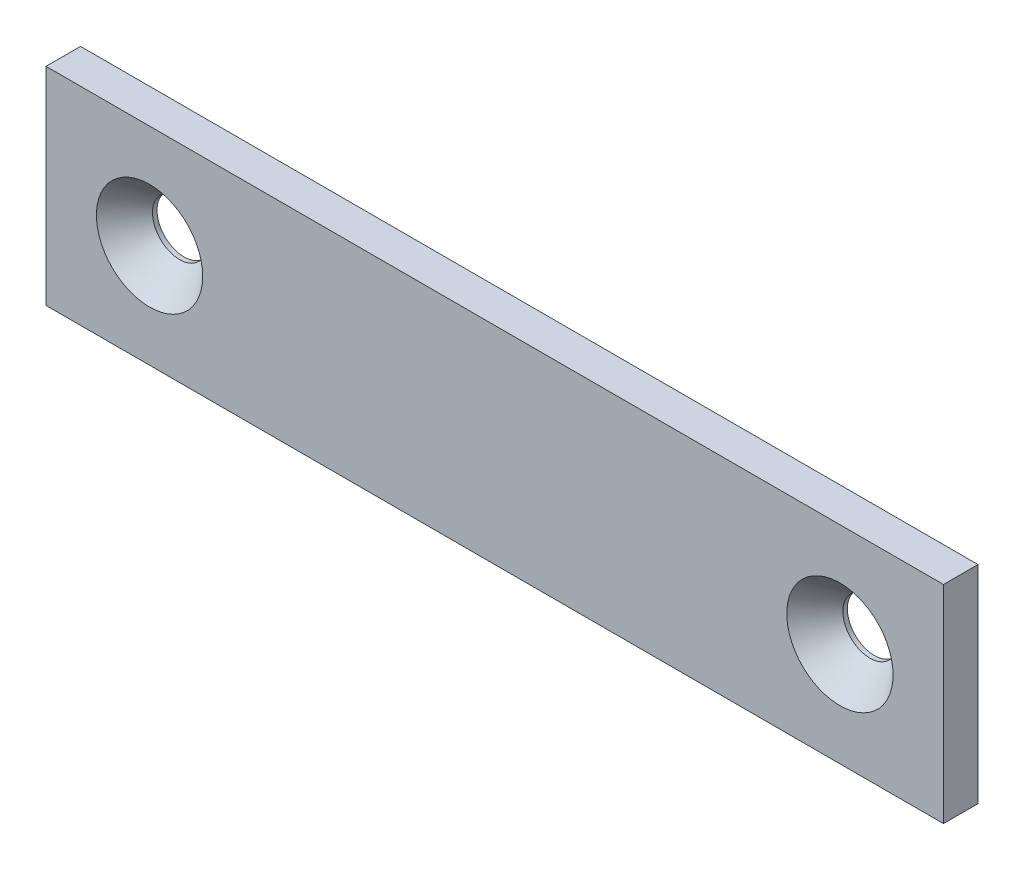
ISO-10303-21;
HEADER;
FILE_DESCRIPTION(('STEP AP214'),'2;1');
FILE_NAME('part.step','',(''),(''),'','','');
FILE_SCHEMA(('AUTOMOTIVE_DESIGN { 1 0 10303 214 1 1 1 1 }'));
ENDSEC;
DATA;
#1=APPLICATION_CONTEXT('core data for automotive mechanical design processes');
#2=APPLICATION_PROTOCOL_DEFINITION('international standard','automotive_design',2000,#1);
#3=PRODUCT_CONTEXT('',#1,'mechanical');
#4=PRODUCT('Part','Part','',(#3));
#5=PRODUCT_RELATED_PRODUCT_CATEGORY('part','',(#4));
#6=PRODUCT_DEFINITION_FORMATION('','',#4);
#7=PRODUCT_DEFINITION_CONTEXT('part definition',#1,'design');
#8=PRODUCT_DEFINITION('design','',#6,#7);
#9=PRODUCT_DEFINITION_SHAPE('','',#8);
#10=(LENGTH_UNIT() NAMED_UNIT(*) SI_UNIT(.MILLI.,.METRE.));
#11=(NAMED_UNIT(*) PLANE_ANGLE_UNIT() SI_UNIT($,.RADIAN.));
#12=(NAMED_UNIT(*) SI_UNIT($,.STERADIAN.) SOLID_ANGLE_UNIT());
#13=UNCERTAINTY_MEASURE_WITH_UNIT(LENGTH_MEASURE(1.E-05),#10,'distance_accuracy_value','');
#14=(GEOMETRIC_REPRESENTATION_CONTEXT(3) GLOBAL_UNCERTAINTY_ASSIGNED_CONTEXT((#13)) GLOBAL_UNIT_ASSIGNED_CONTEXT((#10,
#11,#12)) REPRESENTATION_CONTEXT('',''));
#15=CARTESIAN_POINT('',(0.,0.,0.));
#16=DIRECTION('',(0.,0.,1.));
#17=DIRECTION('',(1.,0.,0.));
#18=AXIS2_PLACEMENT_3D('',#15,#16,#17);
#19=CARTESIAN_POINT('',(-41.275,9.525,1.5875));
#20=DIRECTION('',(1.,0.,0.));
#21=DIRECTION('',(0.,0.,-1.));
#22=AXIS2_PLACEMENT_3D('',#19,#20,#21);
#23=PLANE('',#22);
#24=DIRECTION('',(0.,-1.,0.));
#25=VECTOR('',#24,1.);
#26=CARTESIAN_POINT('',(-41.275,9.525,-1.5875));
#27=LINE('',#26,#25);
#28=CARTESIAN_POINT('',(-41.275,9.525,-1.5875));
#29=VERTEX_POINT('',#28);
#30=CARTESIAN_POINT('',(-41.275,-9.525,-1.5875));
#31=VERTEX_POINT('',#30);
#32=EDGE_CURVE('E99',#29,#31,#27,.T.);
#33=ORIENTED_EDGE('',*,*,#32,.T.);
#34=DIRECTION('',(0.,0.,-1.));
#35=VECTOR('',#34,1.);
#36=CARTESIAN_POINT('',(-41.275,-9.525,1.5875));
#37=LINE('',#36,#35);
#38=CARTESIAN_POINT('',(-41.275,-9.525,1.5875));
#39=VERTEX_POINT('',#38);
#40=EDGE_CURVE('E11',#39,#31,#37,.T.);
#41=ORIENTED_EDGE('',*,*,#40,.F.);
#42=DIRECTION('',(0.,-1.,0.));
#43=VECTOR('',#42,1.);
#44=CARTESIAN_POINT('',(-41.275,9.525,1.5875));
#45=LINE('',#44,#43);
#46=CARTESIAN_POINT('',(-41.275,9.525,1.5875));
#47=VERTEX_POINT('',#46);
#48=EDGE_CURVE('E87',#47,#39,#45,.T.);
#49=ORIENTED_EDGE('',*,*,#48,.F.);
#50=DIRECTION('',(0.,0.,-1.));
#51=VECTOR('',#50,1.);
#52=CARTESIAN_POINT('',(-41.275,9.525,1.5875));
#53=LINE('',#52,#51);
#54=EDGE_CURVE('E95',#47,#29,#53,.T.);
#55=ORIENTED_EDGE('',*,*,#54,.T.);
#56=EDGE_LOOP('',(#33,#41,#49,#55));
#57=FACE_BOUND('',#56,.T.);
#58=ADVANCED_FACE('F36',(#57),#23,.F.);
#59=CARTESIAN_POINT('',(-41.275,-9.525,1.5875));
#60=DIRECTION('',(0.,1.,0.));
#61=DIRECTION('',(-1.,0.,0.));
#62=AXIS2_PLACEMENT_3D('',#59,#60,#61);
#63=PLANE('',#62);
#64=DIRECTION('',(1.,0.,0.));
#65=VECTOR('',#64,1.);
#66=CARTESIAN_POINT('',(-41.275,-9.525,-1.5875));
#67=LINE('',#66,#65);
#68=CARTESIAN_POINT('',(41.275,-9.525,-1.5875));
#69=VERTEX_POINT('',#68);
#70=EDGE_CURVE('E91',#31,#69,#67,.T.);
#71=ORIENTED_EDGE('',*,*,#70,.T.);
#72=DIRECTION('',(0.,0.,-1.));
#73=VECTOR('',#72,1.);
#74=CARTESIAN_POINT('',(41.275,-9.525,1.5875));
#75=LINE('',#74,#73);
#76=CARTESIAN_POINT('',(41.275,-9.525,1.5875));
#77=VERTEX_POINT('',#76);
#78=EDGE_CURVE('E44',#77,#69,#75,.T.);
#79=ORIENTED_EDGE('',*,*,#78,.F.);
#80=DIRECTION('',(1.,0.,0.));
#81=VECTOR('',#80,1.);
#82=CARTESIAN_POINT('',(-41.275,-9.525,1.5875));
#83=LINE('',#82,#81);
#84=EDGE_CURVE('E82',#39,#77,#83,.T.);
#85=ORIENTED_EDGE('',*,*,#84,.F.);
#86=ORIENTED_EDGE('',*,*,#40,.T.);
#87=EDGE_LOOP('',(#71,#79,#85,#86));
#88=FACE_BOUND('',#87,.T.);
#89=ADVANCED_FACE('F90',(#88),#63,.F.);
#90=CARTESIAN_POINT('',(41.275,9.525,1.5875));
#91=DIRECTION('',(-1.,0.,0.));
#92=DIRECTION('',(0.,0.,1.));
#93=AXIS2_PLACEMENT_3D('',#90,#91,#92);
#94=PLANE('',#93);
#95=DIRECTION('',(0.,1.,0.));
#96=VECTOR('',#95,1.);
#97=CARTESIAN_POINT('',(41.275,9.525,-1.5875));
#98=LINE('',#97,#96);
#99=CARTESIAN_POINT('',(41.275,9.525,-1.5875));
#100=VERTEX_POINT('',#99);
#101=EDGE_CURVE('E69',#69,#100,#98,.T.);
#102=ORIENTED_EDGE('',*,*,#101,.T.);
#103=DIRECTION('',(0.,0.,-1.));
#104=VECTOR('',#103,1.);
#105=CARTESIAN_POINT('',(41.275,9.525,1.5875));
#106=LINE('',#105,#104);
#107=CARTESIAN_POINT('',(41.275,9.525,1.5875));
#108=VERTEX_POINT('',#107);
#109=EDGE_CURVE('E92',#108,#100,#106,.T.);
#110=ORIENTED_EDGE('',*,*,#109,.F.);
#111=DIRECTION('',(0.,1.,0.));
#112=VECTOR('',#111,1.);
#113=CARTESIAN_POINT('',(41.275,9.525,1.5875));
#114=LINE('',#113,#112);
#115=EDGE_CURVE('E85',#77,#108,#114,.T.);
#116=ORIENTED_EDGE('',*,*,#115,.F.);
#117=ORIENTED_EDGE('',*,*,#78,.T.);
#118=EDGE_LOOP('',(#102,#110,#116,#117));
#119=FACE_BOUND('',#118,.T.);
#120=ADVANCED_FACE('F93',(#119),#94,.F.);
#121=CARTESIAN_POINT('',(-41.275,9.525,1.5875));
#122=DIRECTION('',(0.,-1.,0.));
#123=DIRECTION('',(1.,0.,0.));
#124=AXIS2_PLACEMENT_3D('',#121,#122,#123);
#125=PLANE('',#124);
#126=DIRECTION('',(-1.,0.,0.));
#127=VECTOR('',#126,1.);
#128=CARTESIAN_POINT('',(-41.275,9.525,-1.5875));
#129=LINE('',#128,#127);
#130=EDGE_CURVE('E75',#100,#29,#129,.T.);
#131=ORIENTED_EDGE('',*,*,#130,.T.);
#132=ORIENTED_EDGE('',*,*,#54,.F.);
#133=DIRECTION('',(-1.,0.,0.));
#134=VECTOR('',#133,1.);
#135=CARTESIAN_POINT('',(-41.275,9.525,1.5875));
#136=LINE('',#135,#134);
#137=EDGE_CURVE('E52',#108,#47,#136,.T.);
#138=ORIENTED_EDGE('',*,*,#137,.F.);
#139=ORIENTED_EDGE('',*,*,#109,.T.);
#140=EDGE_LOOP('',(#131,#132,#138,#139));
#141=FACE_BOUND('',#140,.T.);
#142=ADVANCED_FACE('F107',(#141),#125,.F.);
#143=CARTESIAN_POINT('',(-41.275,-9.525,1.5875));
#144=DIRECTION('',(0.,0.,1.));
#145=DIRECTION('',(1.,0.,0.));
#146=AXIS2_PLACEMENT_3D('',#143,#144,#145);
#147=PLANE('',#146);
#148=CARTESIAN_POINT('',(-31.75,0.,1.5875));
#149=DIRECTION('',(0.,0.,1.));
#150=DIRECTION('',(1.,0.,0.));
#151=AXIS2_PLACEMENT_3D('',#148,#149,#150);
#152=CIRCLE('',#151,4.8895);
#153=CARTESIAN_POINT('',(-26.8605,0.,1.5875));
#154=VERTEX_POINT('',#153);
#155=EDGE_CURVE('E127',#154,#154,#152,.T.);
#156=ORIENTED_EDGE('',*,*,#155,.F.);
#157=EDGE_LOOP('',(#156));
#158=FACE_BOUND('',#157,.T.);
#159=CARTESIAN_POINT('',(31.75,0.,1.5875));
#160=DIRECTION('',(0.,0.,1.));
#161=DIRECTION('',(1.,0.,0.));
#162=AXIS2_PLACEMENT_3D('',#159,#160,#161);
#163=CIRCLE('',#162,4.8895);
#164=CARTESIAN_POINT('',(36.6395,0.,1.5875));
#165=VERTEX_POINT('',#164);
#166=EDGE_CURVE('E118',#165,#165,#163,.T.);
#167=ORIENTED_EDGE('',*,*,#166,.F.);
#168=EDGE_LOOP('',(#167));
#169=FACE_BOUND('',#168,.T.);
#170=ORIENTED_EDGE('',*,*,#48,.T.);
#171=ORIENTED_EDGE('',*,*,#84,.T.);
#172=ORIENTED_EDGE('',*,*,#115,.T.);
#173=ORIENTED_EDGE('',*,*,#137,.T.);
#174=EDGE_LOOP('',(#170,#171,#172,#173));
#175=FACE_BOUND('',#174,.T.);
#176=ADVANCED_FACE('F83',(#158,#169,#175),#147,.T.);
#177=CARTESIAN_POINT('',(-41.275,-9.525,-1.5875));
#178=DIRECTION('',(0.,0.,1.));
#179=DIRECTION('',(1.,0.,0.));
#180=AXIS2_PLACEMENT_3D('',#177,#178,#179);
#181=PLANE('',#180);
#182=CARTESIAN_POINT('',(-31.75,0.,-1.5875));
#183=DIRECTION('',(0.,0.,1.));
#184=DIRECTION('',(1.,0.,0.));
#185=AXIS2_PLACEMENT_3D('',#182,#183,#184);
#186=CIRCLE('',#185,2.4892);
#187=CARTESIAN_POINT('',(-29.2608,0.,-1.5875));
#188=VERTEX_POINT('',#187);
#189=EDGE_CURVE('E121',#188,#188,#186,.T.);
#190=ORIENTED_EDGE('',*,*,#189,.T.);
#191=EDGE_LOOP('',(#190));
#192=FACE_BOUND('',#191,.T.);
#193=CARTESIAN_POINT('',(31.75,0.,-1.5875));
#194=DIRECTION('',(0.,0.,1.));
#195=DIRECTION('',(1.,0.,0.));
#196=AXIS2_PLACEMENT_3D('',#193,#194,#195);
#197=CIRCLE('',#196,2.4892);
#198=CARTESIAN_POINT('',(34.2392,0.,-1.5875));
#199=VERTEX_POINT('',#198);
#200=EDGE_CURVE('E102',#199,#199,#197,.T.);
#201=ORIENTED_EDGE('',*,*,#200,.T.);
#202=EDGE_LOOP('',(#201));
#203=FACE_BOUND('',#202,.T.);
#204=ORIENTED_EDGE('',*,*,#32,.F.);
#205=ORIENTED_EDGE('',*,*,#130,.F.);
#206=ORIENTED_EDGE('',*,*,#101,.F.);
#207=ORIENTED_EDGE('',*,*,#70,.F.);
#208=EDGE_LOOP('',(#204,#205,#206,#207));
#209=FACE_BOUND('',#208,.T.);
#210=ADVANCED_FACE('F110',(#192,#203,#209),#181,.F.);
#211=CARTESIAN_POINT('',(31.75,0.,1.5875));
#212=DIRECTION('',(0.,0.,1.));
#213=DIRECTION('',(1.,0.,0.));
#214=AXIS2_PLACEMENT_3D('',#211,#212,#213);
#215=CYLINDRICAL_SURFACE('',#214,2.4892);
#216=ORIENTED_EDGE('',*,*,#200,.F.);
#217=EDGE_LOOP('',(#216));
#218=FACE_BOUND('',#217,.T.);
#219=CARTESIAN_POINT('',(31.75,0.,-1.17372928785259));
#220=DIRECTION('',(0.,0.,1.));
#221=DIRECTION('',(1.,0.,0.));
#222=AXIS2_PLACEMENT_3D('',#219,#220,#221);
#223=CIRCLE('',#222,2.4892);
#224=CARTESIAN_POINT('',(34.2392,0.,-1.17372928785259));
#225=VERTEX_POINT('',#224);
#226=EDGE_CURVE('E115',#225,#225,#223,.T.);
#227=ORIENTED_EDGE('',*,*,#226,.T.);
#228=EDGE_LOOP('',(#227));
#229=FACE_BOUND('',#228,.T.);
#230=ADVANCED_FACE('F141',(#218,#229),#215,.F.);
#231=CARTESIAN_POINT('',(31.75,0.,1.5875));
#232=DIRECTION('',(0.,0.,1.));
#233=DIRECTION('',(1.,0.,0.));
#234=AXIS2_PLACEMENT_3D('',#231,#232,#233);
#235=CONICAL_SURFACE('',#234,4.8895,0.715584993317675);
#236=ORIENTED_EDGE('',*,*,#226,.F.);
#237=EDGE_LOOP('',(#236));
#238=FACE_BOUND('',#237,.T.);
#239=ORIENTED_EDGE('',*,*,#166,.T.);
#240=EDGE_LOOP('',(#239));
#241=FACE_BOUND('',#240,.T.);
#242=ADVANCED_FACE('F138',(#238,#241),#235,.F.);
#243=CARTESIAN_POINT('',(-31.75,0.,1.5875));
#244=DIRECTION('',(0.,0.,1.));
#245=DIRECTION('',(1.,0.,0.));
#246=AXIS2_PLACEMENT_3D('',#243,#244,#245);
#247=CYLINDRICAL_SURFACE('',#246,2.4892);
#248=ORIENTED_EDGE('',*,*,#189,.F.);
#249=EDGE_LOOP('',(#248));
#250=FACE_BOUND('',#249,.T.);
#251=CARTESIAN_POINT('',(-31.75,0.,-1.17372928785259));
#252=DIRECTION('',(0.,0.,1.));
#253=DIRECTION('',(1.,0.,0.));
#254=AXIS2_PLACEMENT_3D('',#251,#252,#253);
#255=CIRCLE('',#254,2.4892);
#256=CARTESIAN_POINT('',(-29.2608,0.,-1.17372928785259));
#257=VERTEX_POINT('',#256);
#258=EDGE_CURVE('E124',#257,#257,#255,.T.);
#259=ORIENTED_EDGE('',*,*,#258,.T.);
#260=EDGE_LOOP('',(#259));
#261=FACE_BOUND('',#260,.T.);
#262=ADVANCED_FACE('F140',(#250,#261),#247,.F.);
#263=CARTESIAN_POINT('',(-31.75,0.,1.5875));
#264=DIRECTION('',(0.,0.,1.));
#265=DIRECTION('',(1.,0.,0.));
#266=AXIS2_PLACEMENT_3D('',#263,#264,#265);
#267=CONICAL_SURFACE('',#266,4.8895,0.715584993317675);
#268=ORIENTED_EDGE('',*,*,#258,.F.);
#269=EDGE_LOOP('',(#268));
#270=FACE_BOUND('',#269,.T.);
#271=ORIENTED_EDGE('',*,*,#155,.T.);
#272=EDGE_LOOP('',(#271));
#273=FACE_BOUND('',#272,.T.);
#274=ADVANCED_FACE('F131',(#270,#273),#267,.F.);
#275=CLOSED_SHELL('',(#58,#89,#120,#142,#176,#210,#230,#242,#262,#274));
#276=MANIFOLD_SOLID_BREP('B2',#275);
#277=ADVANCED_BREP_SHAPE_REPRESENTATION('',(#18,#276),#14);
#278=SHAPE_DEFINITION_REPRESENTATION(#9,#277);
ENDSEC;
END-ISO-10303-21;
